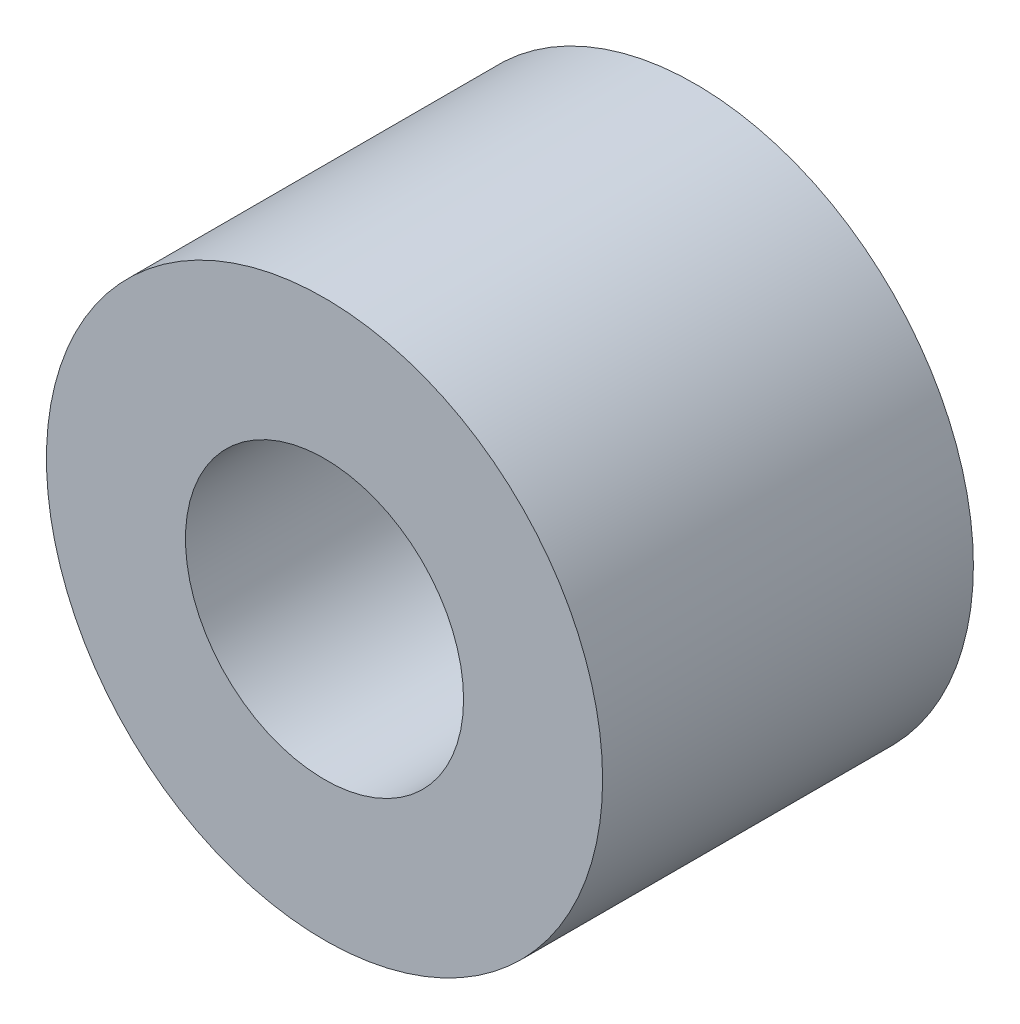
ISO-10303-21;
HEADER;
FILE_DESCRIPTION(('STEP AP214'),'2;1');
FILE_NAME('part.step','',(''),(''),'','','');
FILE_SCHEMA(('AUTOMOTIVE_DESIGN { 1 0 10303 214 1 1 1 1 }'));
ENDSEC;
DATA;
#1=APPLICATION_CONTEXT('core data for automotive mechanical design processes');
#2=APPLICATION_PROTOCOL_DEFINITION('international standard','automotive_design',2000,#1);
#3=PRODUCT_CONTEXT('',#1,'mechanical');
#4=PRODUCT('Part','Part','',(#3));
#5=PRODUCT_RELATED_PRODUCT_CATEGORY('part','',(#4));
#6=PRODUCT_DEFINITION_FORMATION('','',#4);
#7=PRODUCT_DEFINITION_CONTEXT('part definition',#1,'design');
#8=PRODUCT_DEFINITION('design','',#6,#7);
#9=PRODUCT_DEFINITION_SHAPE('','',#8);
#10=(LENGTH_UNIT() NAMED_UNIT(*) SI_UNIT(.MILLI.,.METRE.));
#11=(NAMED_UNIT(*) PLANE_ANGLE_UNIT() SI_UNIT($,.RADIAN.));
#12=(NAMED_UNIT(*) SI_UNIT($,.STERADIAN.) SOLID_ANGLE_UNIT());
#13=UNCERTAINTY_MEASURE_WITH_UNIT(LENGTH_MEASURE(1.E-05),#10,'distance_accuracy_value','');
#14=(GEOMETRIC_REPRESENTATION_CONTEXT(3) GLOBAL_UNCERTAINTY_ASSIGNED_CONTEXT((#13)) GLOBAL_UNIT_ASSIGNED_CONTEXT((#10,
#11,#12)) REPRESENTATION_CONTEXT('',''));
#15=CARTESIAN_POINT('',(0.,0.,0.));
#16=DIRECTION('',(0.,0.,1.));
#17=DIRECTION('',(1.,0.,0.));
#18=AXIS2_PLACEMENT_3D('',#15,#16,#17);
#19=CARTESIAN_POINT('',(3.00000001284848,3.00000014073586,8.00000018998981));
#20=DIRECTION('',(0.,0.,1.));
#21=DIRECTION('',(1.,0.,0.));
#22=AXIS2_PLACEMENT_3D('',#19,#20,#21);
#23=PLANE('',#22);
#24=CARTESIAN_POINT('',(3.00000001284848,3.00000014073586,8.00000018998981));
#25=DIRECTION('',(0.,0.,1.));
#26=DIRECTION('',(1.,0.,0.));
#27=AXIS2_PLACEMENT_3D('',#24,#25,#26);
#28=CIRCLE('',#27,3.00000006343552);
#29=CARTESIAN_POINT('',(6.00000007628401,3.00000014073586,8.00000018998981));
#30=VERTEX_POINT('',#29);
#31=EDGE_CURVE('E11',#30,#30,#28,.T.);
#32=ORIENTED_EDGE('',*,*,#31,.T.);
#33=EDGE_LOOP('',(#32));
#34=FACE_BOUND('',#33,.T.);
#35=CARTESIAN_POINT('',(3.00000015584211,3.00000009402538,8.00000018998981));
#36=DIRECTION('',(0.,0.,1.));
#37=DIRECTION('',(1.,0.,0.));
#38=AXIS2_PLACEMENT_3D('',#35,#36,#37);
#39=CIRCLE('',#38,1.50000007558478);
#40=CARTESIAN_POINT('',(4.50000023142689,3.00000009402538,8.00000018998981));
#41=VERTEX_POINT('',#40);
#42=EDGE_CURVE('E52',#41,#41,#39,.T.);
#43=ORIENTED_EDGE('',*,*,#42,.F.);
#44=EDGE_LOOP('',(#43));
#45=FACE_BOUND('',#44,.T.);
#46=ADVANCED_FACE('F41',(#34,#45),#23,.T.);
#47=CARTESIAN_POINT('',(3.00000001284848,3.00000014073586,4.00000018998981));
#48=DIRECTION('',(0.,0.,1.));
#49=DIRECTION('',(1.,0.,0.));
#50=AXIS2_PLACEMENT_3D('',#47,#48,#49);
#51=PLANE('',#50);
#52=CARTESIAN_POINT('',(3.00000001284848,3.00000014073586,4.00000018998981));
#53=DIRECTION('',(0.,0.,1.));
#54=DIRECTION('',(1.,0.,0.));
#55=AXIS2_PLACEMENT_3D('',#52,#53,#54);
#56=CIRCLE('',#55,3.00000006343552);
#57=CARTESIAN_POINT('',(6.00000007628401,3.00000014073586,4.00000018998981));
#58=VERTEX_POINT('',#57);
#59=EDGE_CURVE('E45',#58,#58,#56,.T.);
#60=ORIENTED_EDGE('',*,*,#59,.F.);
#61=EDGE_LOOP('',(#60));
#62=FACE_BOUND('',#61,.T.);
#63=CARTESIAN_POINT('',(3.00000015584211,3.00000009402538,4.00000018998981));
#64=DIRECTION('',(0.,0.,1.));
#65=DIRECTION('',(1.,0.,0.));
#66=AXIS2_PLACEMENT_3D('',#63,#64,#65);
#67=CIRCLE('',#66,1.50000007558478);
#68=CARTESIAN_POINT('',(4.50000023142689,3.00000009402538,4.00000018998981));
#69=VERTEX_POINT('',#68);
#70=EDGE_CURVE('E54',#69,#69,#67,.T.);
#71=ORIENTED_EDGE('',*,*,#70,.T.);
#72=EDGE_LOOP('',(#71));
#73=FACE_BOUND('',#72,.T.);
#74=ADVANCED_FACE('F64',(#62,#73),#51,.F.);
#75=CARTESIAN_POINT('',(3.00000001284848,3.00000014073586,8.00000018998981));
#76=DIRECTION('',(0.,0.,-1.));
#77=DIRECTION('',(-1.,0.,0.));
#78=AXIS2_PLACEMENT_3D('',#75,#76,#77);
#79=CYLINDRICAL_SURFACE('',#78,3.00000006343552);
#80=ORIENTED_EDGE('',*,*,#31,.F.);
#81=EDGE_LOOP('',(#80));
#82=FACE_BOUND('',#81,.T.);
#83=ORIENTED_EDGE('',*,*,#59,.T.);
#84=EDGE_LOOP('',(#83));
#85=FACE_BOUND('',#84,.T.);
#86=ADVANCED_FACE('F43',(#82,#85),#79,.T.);
#87=CARTESIAN_POINT('',(3.00000015584211,3.00000009402538,8.00000018998981));
#88=DIRECTION('',(0.,0.,-1.));
#89=DIRECTION('',(-1.,0.,0.));
#90=AXIS2_PLACEMENT_3D('',#87,#88,#89);
#91=CYLINDRICAL_SURFACE('',#90,1.50000007558478);
#92=ORIENTED_EDGE('',*,*,#42,.T.);
#93=EDGE_LOOP('',(#92));
#94=FACE_BOUND('',#93,.T.);
#95=ORIENTED_EDGE('',*,*,#70,.F.);
#96=EDGE_LOOP('',(#95));
#97=FACE_BOUND('',#96,.T.);
#98=ADVANCED_FACE('F60',(#94,#97),#91,.F.);
#99=CLOSED_SHELL('',(#46,#74,#86,#98));
#100=MANIFOLD_SOLID_BREP('B2',#99);
#101=ADVANCED_BREP_SHAPE_REPRESENTATION('',(#18,#100),#14);
#102=SHAPE_DEFINITION_REPRESENTATION(#9,#101);
ENDSEC;
END-ISO-10303-21;
